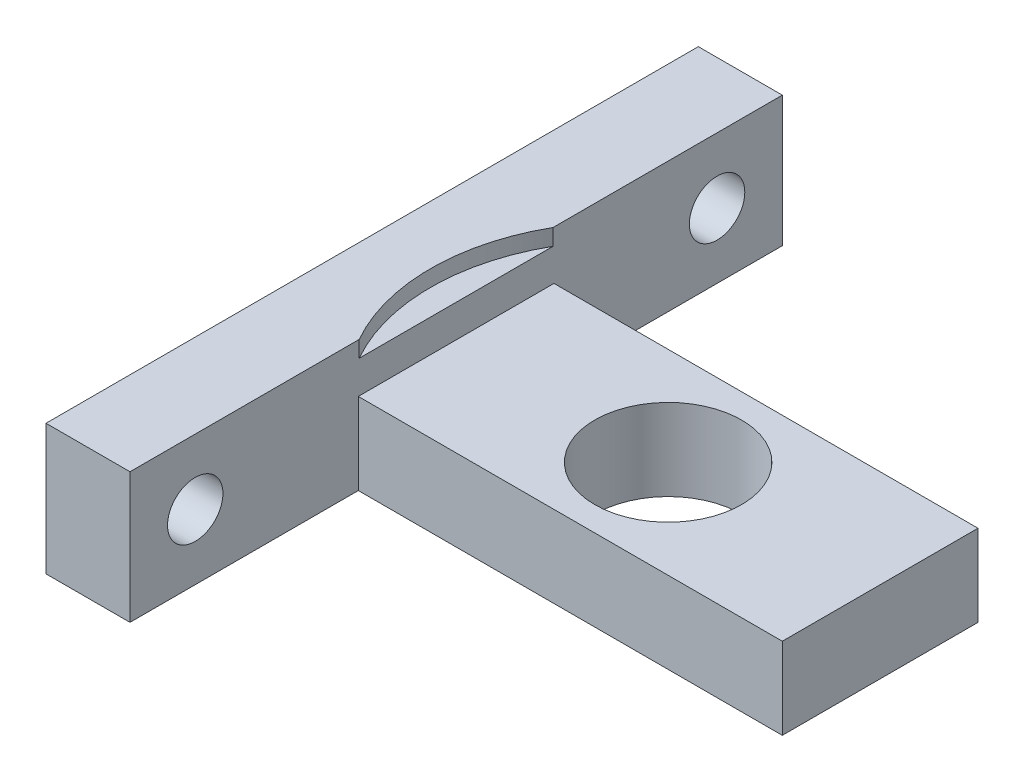
ISO-10303-21;
HEADER;
FILE_DESCRIPTION(('STEP AP214'),'2;1');
FILE_NAME('part.step','',(''),(''),'','','');
FILE_SCHEMA(('AUTOMOTIVE_DESIGN { 1 0 10303 214 1 1 1 1 }'));
ENDSEC;
DATA;
#1=APPLICATION_CONTEXT('core data for automotive mechanical design processes');
#2=APPLICATION_PROTOCOL_DEFINITION('international standard','automotive_design',2000,#1);
#3=PRODUCT_CONTEXT('',#1,'mechanical');
#4=PRODUCT('Part','Part','',(#3));
#5=PRODUCT_RELATED_PRODUCT_CATEGORY('part','',(#4));
#6=PRODUCT_DEFINITION_FORMATION('','',#4);
#7=PRODUCT_DEFINITION_CONTEXT('part definition',#1,'design');
#8=PRODUCT_DEFINITION('design','',#6,#7);
#9=PRODUCT_DEFINITION_SHAPE('','',#8);
#10=(LENGTH_UNIT() NAMED_UNIT(*) SI_UNIT(.MILLI.,.METRE.));
#11=(NAMED_UNIT(*) PLANE_ANGLE_UNIT() SI_UNIT($,.RADIAN.));
#12=(NAMED_UNIT(*) SI_UNIT($,.STERADIAN.) SOLID_ANGLE_UNIT());
#13=UNCERTAINTY_MEASURE_WITH_UNIT(LENGTH_MEASURE(1.E-05),#10,'distance_accuracy_value','');
#14=(GEOMETRIC_REPRESENTATION_CONTEXT(3) GLOBAL_UNCERTAINTY_ASSIGNED_CONTEXT((#13)) GLOBAL_UNIT_ASSIGNED_CONTEXT((#10,
#11,#12)) REPRESENTATION_CONTEXT('',''));
#15=CARTESIAN_POINT('',(0.,0.,0.));
#16=DIRECTION('',(0.,0.,1.));
#17=DIRECTION('',(1.,0.,0.));
#18=AXIS2_PLACEMENT_3D('',#15,#16,#17);
#19=CARTESIAN_POINT('',(-2.575,-8.,20.));
#20=DIRECTION('',(-1.,0.,0.));
#21=DIRECTION('',(0.,0.,1.));
#22=AXIS2_PLACEMENT_3D('',#19,#20,#21);
#23=PLANE('',#22);
#24=CARTESIAN_POINT('',(-2.575,-4.,16.));
#25=DIRECTION('',(-1.,0.,0.));
#26=DIRECTION('',(0.,0.,1.));
#27=AXIS2_PLACEMENT_3D('',#24,#25,#26);
#28=CIRCLE('',#27,1.7);
#29=CARTESIAN_POINT('',(-2.575,-4.,17.7));
#30=VERTEX_POINT('',#29);
#31=EDGE_CURVE('E169',#30,#30,#28,.T.);
#32=ORIENTED_EDGE('',*,*,#31,.F.);
#33=EDGE_LOOP('',(#32));
#34=FACE_BOUND('',#33,.T.);
#35=CARTESIAN_POINT('',(-2.575,-4.,-16.));
#36=DIRECTION('',(-1.,0.,0.));
#37=DIRECTION('',(0.,0.,1.));
#38=AXIS2_PLACEMENT_3D('',#35,#36,#37);
#39=CIRCLE('',#38,1.7);
#40=CARTESIAN_POINT('',(-2.575,-4.,-14.3));
#41=VERTEX_POINT('',#40);
#42=EDGE_CURVE('E164',#41,#41,#39,.T.);
#43=ORIENTED_EDGE('',*,*,#42,.F.);
#44=EDGE_LOOP('',(#43));
#45=FACE_BOUND('',#44,.T.);
#46=DIRECTION('',(0.,0.,1.));
#47=VECTOR('',#46,1.);
#48=CARTESIAN_POINT('',(-2.575,0.,20.));
#49=LINE('',#48,#47);
#50=CARTESIAN_POINT('',(-2.575,0.,-20.));
#51=VERTEX_POINT('',#50);
#52=CARTESIAN_POINT('',(-2.575,0.,20.));
#53=VERTEX_POINT('',#52);
#54=EDGE_CURVE('E172',#51,#53,#49,.T.);
#55=ORIENTED_EDGE('',*,*,#54,.F.);
#56=DIRECTION('',(0.,1.,0.));
#57=VECTOR('',#56,1.);
#58=CARTESIAN_POINT('',(-2.575,-8.,-20.));
#59=LINE('',#58,#57);
#60=CARTESIAN_POINT('',(-2.575,-8.,-20.));
#61=VERTEX_POINT('',#60);
#62=EDGE_CURVE('E43',#61,#51,#59,.T.);
#63=ORIENTED_EDGE('',*,*,#62,.F.);
#64=DIRECTION('',(0.,0.,1.));
#65=VECTOR('',#64,1.);
#66=CARTESIAN_POINT('',(-2.575,-8.,20.));
#67=LINE('',#66,#65);
#68=CARTESIAN_POINT('',(-2.575,-8.,20.));
#69=VERTEX_POINT('',#68);
#70=EDGE_CURVE('E173',#61,#69,#67,.T.);
#71=ORIENTED_EDGE('',*,*,#70,.T.);
#72=DIRECTION('',(0.,1.,0.));
#73=VECTOR('',#72,1.);
#74=CARTESIAN_POINT('',(-2.575,-8.,20.));
#75=LINE('',#74,#73);
#76=EDGE_CURVE('E187',#69,#53,#75,.T.);
#77=ORIENTED_EDGE('',*,*,#76,.T.);
#78=EDGE_LOOP('',(#55,#63,#71,#77));
#79=FACE_BOUND('',#78,.T.);
#80=ADVANCED_FACE('F36',(#34,#45,#79),#23,.T.);
#81=CARTESIAN_POINT('',(2.575,-8.,-20.));
#82=DIRECTION('',(0.,0.,-1.));
#83=DIRECTION('',(-1.,0.,0.));
#84=AXIS2_PLACEMENT_3D('',#81,#82,#83);
#85=PLANE('',#84);
#86=DIRECTION('',(-1.,0.,0.));
#87=VECTOR('',#86,1.);
#88=CARTESIAN_POINT('',(2.575,0.,-20.));
#89=LINE('',#88,#87);
#90=CARTESIAN_POINT('',(2.575,0.,-20.));
#91=VERTEX_POINT('',#90);
#92=EDGE_CURVE('E177',#91,#51,#89,.T.);
#93=ORIENTED_EDGE('',*,*,#92,.F.);
#94=DIRECTION('',(0.,1.,0.));
#95=VECTOR('',#94,1.);
#96=CARTESIAN_POINT('',(2.575,-8.,-20.));
#97=LINE('',#96,#95);
#98=CARTESIAN_POINT('',(2.575,-8.,-20.));
#99=VERTEX_POINT('',#98);
#100=EDGE_CURVE('E199',#99,#91,#97,.T.);
#101=ORIENTED_EDGE('',*,*,#100,.F.);
#102=DIRECTION('',(-1.,0.,0.));
#103=VECTOR('',#102,1.);
#104=CARTESIAN_POINT('',(2.575,-8.,-20.));
#105=LINE('',#104,#103);
#106=EDGE_CURVE('E184',#99,#61,#105,.T.);
#107=ORIENTED_EDGE('',*,*,#106,.T.);
#108=ORIENTED_EDGE('',*,*,#62,.T.);
#109=EDGE_LOOP('',(#93,#101,#107,#108));
#110=FACE_BOUND('',#109,.T.);
#111=ADVANCED_FACE('F215',(#110),#85,.T.);
#112=CARTESIAN_POINT('',(2.575,-8.,20.));
#113=DIRECTION('',(1.,0.,0.));
#114=DIRECTION('',(0.,0.,-1.));
#115=AXIS2_PLACEMENT_3D('',#112,#113,#114);
#116=PLANE('',#115);
#117=DIRECTION('',(0.,1.,0.));
#118=VECTOR('',#117,1.);
#119=CARTESIAN_POINT('',(2.575,-1.,-5.94301060069727));
#120=LINE('',#119,#118);
#121=CARTESIAN_POINT('',(2.575,-1.,-5.94301060069727));
#122=VERTEX_POINT('',#121);
#123=CARTESIAN_POINT('',(2.575,0.,-5.94301060069727));
#124=VERTEX_POINT('',#123);
#125=EDGE_CURVE('E50',#122,#124,#120,.T.);
#126=ORIENTED_EDGE('',*,*,#125,.F.);
#127=DIRECTION('',(0.,0.,1.));
#128=VECTOR('',#127,1.);
#129=CARTESIAN_POINT('',(2.575,-1.,20.));
#130=LINE('',#129,#128);
#131=CARTESIAN_POINT('',(2.575,-1.,5.94301060069727));
#132=VERTEX_POINT('',#131);
#133=EDGE_CURVE('E11',#122,#132,#130,.T.);
#134=ORIENTED_EDGE('',*,*,#133,.T.);
#135=DIRECTION('',(0.,1.,0.));
#136=VECTOR('',#135,1.);
#137=CARTESIAN_POINT('',(2.575,-1.,5.94301060069727));
#138=LINE('',#137,#136);
#139=CARTESIAN_POINT('',(2.575,0.,5.94301060069727));
#140=VERTEX_POINT('',#139);
#141=EDGE_CURVE('E118',#140,#132,#138,.F.);
#142=ORIENTED_EDGE('',*,*,#141,.F.);
#143=DIRECTION('',(0.,0.,-1.));
#144=VECTOR('',#143,1.);
#145=CARTESIAN_POINT('',(2.575,0.,20.));
#146=LINE('',#145,#144);
#147=CARTESIAN_POINT('',(2.575,0.,20.));
#148=VERTEX_POINT('',#147);
#149=EDGE_CURVE('E193',#148,#140,#146,.T.);
#150=ORIENTED_EDGE('',*,*,#149,.F.);
#151=DIRECTION('',(0.,1.,0.));
#152=VECTOR('',#151,1.);
#153=CARTESIAN_POINT('',(2.575,-8.,20.));
#154=LINE('',#153,#152);
#155=CARTESIAN_POINT('',(2.575,-8.,20.));
#156=VERTEX_POINT('',#155);
#157=EDGE_CURVE('E201',#156,#148,#154,.T.);
#158=ORIENTED_EDGE('',*,*,#157,.F.);
#159=DIRECTION('',(0.,0.,-1.));
#160=VECTOR('',#159,1.);
#161=CARTESIAN_POINT('',(2.575,-8.,20.));
#162=LINE('',#161,#160);
#163=CARTESIAN_POINT('',(2.575,-8.,6.));
#164=VERTEX_POINT('',#163);
#165=EDGE_CURVE('E181',#156,#164,#162,.T.);
#166=ORIENTED_EDGE('',*,*,#165,.T.);
#167=DIRECTION('',(0.,-1.,0.));
#168=VECTOR('',#167,1.);
#169=CARTESIAN_POINT('',(2.575,-3.,6.));
#170=LINE('',#169,#168);
#171=CARTESIAN_POINT('',(2.575,-3.,6.));
#172=VERTEX_POINT('',#171);
#173=EDGE_CURVE('E154',#172,#164,#170,.T.);
#174=ORIENTED_EDGE('',*,*,#173,.F.);
#175=DIRECTION('',(0.,0.,1.));
#176=VECTOR('',#175,1.);
#177=CARTESIAN_POINT('',(2.575,-3.,-6.));
#178=LINE('',#177,#176);
#179=CARTESIAN_POINT('',(2.575,-3.,-6.));
#180=VERTEX_POINT('',#179);
#181=EDGE_CURVE('E143',#180,#172,#178,.T.);
#182=ORIENTED_EDGE('',*,*,#181,.F.);
#183=DIRECTION('',(0.,-1.,0.));
#184=VECTOR('',#183,1.);
#185=CARTESIAN_POINT('',(2.575,-3.,-6.));
#186=LINE('',#185,#184);
#187=CARTESIAN_POINT('',(2.575,-8.,-6.00000000000001));
#188=VERTEX_POINT('',#187);
#189=EDGE_CURVE('E156',#180,#188,#186,.T.);
#190=ORIENTED_EDGE('',*,*,#189,.T.);
#191=EDGE_CURVE('E180',#188,#99,#162,.T.);
#192=ORIENTED_EDGE('',*,*,#191,.T.);
#193=ORIENTED_EDGE('',*,*,#100,.T.);
#194=EDGE_CURVE('E125',#124,#91,#146,.T.);
#195=ORIENTED_EDGE('',*,*,#194,.F.);
#196=EDGE_LOOP('',(#126,#134,#142,#150,#158,#166,#174,#182,#190,#192,#193,#195));
#197=FACE_BOUND('',#196,.T.);
#198=CARTESIAN_POINT('',(2.575,-4.,16.));
#199=DIRECTION('',(1.,0.,0.));
#200=DIRECTION('',(0.,0.,-1.));
#201=AXIS2_PLACEMENT_3D('',#198,#199,#200);
#202=CIRCLE('',#201,1.7);
#203=CARTESIAN_POINT('',(2.575,-4.,14.3));
#204=VERTEX_POINT('',#203);
#205=EDGE_CURVE('E161',#204,#204,#202,.T.);
#206=ORIENTED_EDGE('',*,*,#205,.F.);
#207=EDGE_LOOP('',(#206));
#208=FACE_BOUND('',#207,.T.);
#209=CARTESIAN_POINT('',(2.575,-4.,-16.));
#210=DIRECTION('',(1.,0.,0.));
#211=DIRECTION('',(0.,0.,-1.));
#212=AXIS2_PLACEMENT_3D('',#209,#210,#211);
#213=CIRCLE('',#212,1.7);
#214=CARTESIAN_POINT('',(2.575,-4.,-17.7));
#215=VERTEX_POINT('',#214);
#216=EDGE_CURVE('E160',#215,#215,#213,.T.);
#217=ORIENTED_EDGE('',*,*,#216,.F.);
#218=EDGE_LOOP('',(#217));
#219=FACE_BOUND('',#218,.T.);
#220=ADVANCED_FACE('F122',(#197,#208,#219),#116,.T.);
#221=CARTESIAN_POINT('',(2.575,-8.,20.));
#222=DIRECTION('',(0.,0.,1.));
#223=DIRECTION('',(1.,0.,0.));
#224=AXIS2_PLACEMENT_3D('',#221,#222,#223);
#225=PLANE('',#224);
#226=DIRECTION('',(1.,0.,0.));
#227=VECTOR('',#226,1.);
#228=CARTESIAN_POINT('',(2.575,0.,20.));
#229=LINE('',#228,#227);
#230=EDGE_CURVE('E190',#53,#148,#229,.T.);
#231=ORIENTED_EDGE('',*,*,#230,.F.);
#232=ORIENTED_EDGE('',*,*,#76,.F.);
#233=DIRECTION('',(1.,0.,0.));
#234=VECTOR('',#233,1.);
#235=CARTESIAN_POINT('',(2.575,-8.,20.));
#236=LINE('',#235,#234);
#237=EDGE_CURVE('E176',#69,#156,#236,.T.);
#238=ORIENTED_EDGE('',*,*,#237,.T.);
#239=ORIENTED_EDGE('',*,*,#157,.T.);
#240=EDGE_LOOP('',(#231,#232,#238,#239));
#241=FACE_BOUND('',#240,.T.);
#242=ADVANCED_FACE('F208',(#241),#225,.T.);
#243=CARTESIAN_POINT('',(0.,-8.,0.));
#244=DIRECTION('',(0.,1.,0.));
#245=DIRECTION('',(0.,0.,1.));
#246=AXIS2_PLACEMENT_3D('',#243,#244,#245);
#247=PLANE('',#246);
#248=ORIENTED_EDGE('',*,*,#70,.F.);
#249=ORIENTED_EDGE('',*,*,#106,.F.);
#250=ORIENTED_EDGE('',*,*,#191,.F.);
#251=DIRECTION('',(-1.,0.,0.));
#252=VECTOR('',#251,1.);
#253=CARTESIAN_POINT('',(2.575,-8.,-6.));
#254=LINE('',#253,#252);
#255=CARTESIAN_POINT('',(28.575,-8.,-6.));
#256=VERTEX_POINT('',#255);
#257=EDGE_CURVE('E58',#256,#188,#254,.T.);
#258=ORIENTED_EDGE('',*,*,#257,.F.);
#259=DIRECTION('',(0.,0.,-1.));
#260=VECTOR('',#259,1.);
#261=CARTESIAN_POINT('',(28.575,-8.,-6.));
#262=LINE('',#261,#260);
#263=CARTESIAN_POINT('',(28.575,-8.,6.));
#264=VERTEX_POINT('',#263);
#265=EDGE_CURVE('E135',#264,#256,#262,.T.);
#266=ORIENTED_EDGE('',*,*,#265,.F.);
#267=DIRECTION('',(1.,0.,0.));
#268=VECTOR('',#267,1.);
#269=CARTESIAN_POINT('',(2.575,-8.,6.));
#270=LINE('',#269,#268);
#271=EDGE_CURVE('E141',#164,#264,#270,.T.);
#272=ORIENTED_EDGE('',*,*,#271,.F.);
#273=ORIENTED_EDGE('',*,*,#165,.F.);
#274=ORIENTED_EDGE('',*,*,#237,.F.);
#275=EDGE_LOOP('',(#248,#249,#250,#258,#266,#272,#273,#274));
#276=FACE_BOUND('',#275,.T.);
#277=CARTESIAN_POINT('',(15.575,-8.,0.));
#278=DIRECTION('',(0.,1.,0.));
#279=DIRECTION('',(0.,0.,1.));
#280=AXIS2_PLACEMENT_3D('',#277,#278,#279);
#281=CIRCLE('',#280,4.5);
#282=CARTESIAN_POINT('',(15.575,-8.,4.5));
#283=VERTEX_POINT('',#282);
#284=EDGE_CURVE('E126',#283,#283,#281,.T.);
#285=ORIENTED_EDGE('',*,*,#284,.T.);
#286=EDGE_LOOP('',(#285));
#287=FACE_BOUND('',#286,.T.);
#288=ADVANCED_FACE('F218',(#276,#287),#247,.F.);
#289=CARTESIAN_POINT('',(0.,0.,0.));
#290=DIRECTION('',(0.,1.,0.));
#291=DIRECTION('',(0.,0.,1.));
#292=AXIS2_PLACEMENT_3D('',#289,#290,#291);
#293=PLANE('',#292);
#294=CARTESIAN_POINT('',(13.,0.,0.));
#295=DIRECTION('',(0.,1.,0.));
#296=DIRECTION('',(0.,0.,1.));
#297=AXIS2_PLACEMENT_3D('',#294,#295,#296);
#298=CIRCLE('',#297,12.);
#299=EDGE_CURVE('E119',#124,#140,#298,.T.);
#300=ORIENTED_EDGE('',*,*,#299,.F.);
#301=ORIENTED_EDGE('',*,*,#194,.T.);
#302=ORIENTED_EDGE('',*,*,#92,.T.);
#303=ORIENTED_EDGE('',*,*,#54,.T.);
#304=ORIENTED_EDGE('',*,*,#230,.T.);
#305=ORIENTED_EDGE('',*,*,#149,.T.);
#306=EDGE_LOOP('',(#300,#301,#302,#303,#304,#305));
#307=FACE_BOUND('',#306,.T.);
#308=ADVANCED_FACE('F211',(#307),#293,.T.);
#309=CARTESIAN_POINT('',(-8.425,-4.,-16.));
#310=DIRECTION('',(1.,0.,0.));
#311=DIRECTION('',(0.,0.,-1.));
#312=AXIS2_PLACEMENT_3D('',#309,#310,#311);
#313=CYLINDRICAL_SURFACE('',#312,1.7);
#314=ORIENTED_EDGE('',*,*,#42,.T.);
#315=EDGE_LOOP('',(#314));
#316=FACE_BOUND('',#315,.T.);
#317=ORIENTED_EDGE('',*,*,#216,.T.);
#318=EDGE_LOOP('',(#317));
#319=FACE_BOUND('',#318,.T.);
#320=ADVANCED_FACE('F258',(#316,#319),#313,.F.);
#321=CARTESIAN_POINT('',(-8.425,-4.,16.));
#322=DIRECTION('',(1.,0.,0.));
#323=DIRECTION('',(0.,0.,-1.));
#324=AXIS2_PLACEMENT_3D('',#321,#322,#323);
#325=CYLINDRICAL_SURFACE('',#324,1.7);
#326=ORIENTED_EDGE('',*,*,#31,.T.);
#327=EDGE_LOOP('',(#326));
#328=FACE_BOUND('',#327,.T.);
#329=ORIENTED_EDGE('',*,*,#205,.T.);
#330=EDGE_LOOP('',(#329));
#331=FACE_BOUND('',#330,.T.);
#332=ADVANCED_FACE('F245',(#328,#331),#325,.F.);
#333=CARTESIAN_POINT('',(0.,-3.,0.));
#334=DIRECTION('',(0.,1.,0.));
#335=DIRECTION('',(0.,0.,1.));
#336=AXIS2_PLACEMENT_3D('',#333,#334,#335);
#337=PLANE('',#336);
#338=DIRECTION('',(0.,0.,-1.));
#339=VECTOR('',#338,1.);
#340=CARTESIAN_POINT('',(28.575,-3.,-6.));
#341=LINE('',#340,#339);
#342=CARTESIAN_POINT('',(28.575,-3.,6.));
#343=VERTEX_POINT('',#342);
#344=CARTESIAN_POINT('',(28.575,-3.,-6.));
#345=VERTEX_POINT('',#344);
#346=EDGE_CURVE('E137',#343,#345,#341,.T.);
#347=ORIENTED_EDGE('',*,*,#346,.T.);
#348=DIRECTION('',(-1.,0.,0.));
#349=VECTOR('',#348,1.);
#350=CARTESIAN_POINT('',(2.575,-3.,-6.));
#351=LINE('',#350,#349);
#352=EDGE_CURVE('E140',#345,#180,#351,.T.);
#353=ORIENTED_EDGE('',*,*,#352,.T.);
#354=ORIENTED_EDGE('',*,*,#181,.T.);
#355=DIRECTION('',(1.,0.,0.));
#356=VECTOR('',#355,1.);
#357=CARTESIAN_POINT('',(2.575,-3.,6.));
#358=LINE('',#357,#356);
#359=EDGE_CURVE('E145',#172,#343,#358,.T.);
#360=ORIENTED_EDGE('',*,*,#359,.T.);
#361=EDGE_LOOP('',(#347,#353,#354,#360));
#362=FACE_BOUND('',#361,.T.);
#363=CARTESIAN_POINT('',(15.575,-3.,0.));
#364=DIRECTION('',(0.,1.,0.));
#365=DIRECTION('',(0.,0.,1.));
#366=AXIS2_PLACEMENT_3D('',#363,#364,#365);
#367=CIRCLE('',#366,4.5);
#368=CARTESIAN_POINT('',(15.575,-3.,4.5));
#369=VERTEX_POINT('',#368);
#370=EDGE_CURVE('E129',#369,#369,#367,.T.);
#371=ORIENTED_EDGE('',*,*,#370,.F.);
#372=EDGE_LOOP('',(#371));
#373=FACE_BOUND('',#372,.T.);
#374=ADVANCED_FACE('F232',(#362,#373),#337,.T.);
#375=CARTESIAN_POINT('',(28.575,-3.,-6.));
#376=DIRECTION('',(-1.,0.,0.));
#377=DIRECTION('',(0.,0.,1.));
#378=AXIS2_PLACEMENT_3D('',#375,#376,#377);
#379=PLANE('',#378);
#380=ORIENTED_EDGE('',*,*,#265,.T.);
#381=DIRECTION('',(0.,-1.,0.));
#382=VECTOR('',#381,1.);
#383=CARTESIAN_POINT('',(28.575,-3.,-6.));
#384=LINE('',#383,#382);
#385=EDGE_CURVE('E158',#345,#256,#384,.T.);
#386=ORIENTED_EDGE('',*,*,#385,.F.);
#387=ORIENTED_EDGE('',*,*,#346,.F.);
#388=DIRECTION('',(0.,-1.,0.));
#389=VECTOR('',#388,1.);
#390=CARTESIAN_POINT('',(28.575,-3.,6.));
#391=LINE('',#390,#389);
#392=EDGE_CURVE('E147',#343,#264,#391,.T.);
#393=ORIENTED_EDGE('',*,*,#392,.T.);
#394=EDGE_LOOP('',(#380,#386,#387,#393));
#395=FACE_BOUND('',#394,.T.);
#396=ADVANCED_FACE('F237',(#395),#379,.F.);
#397=CARTESIAN_POINT('',(2.575,-3.,-6.));
#398=DIRECTION('',(0.,0.,1.));
#399=DIRECTION('',(1.,0.,0.));
#400=AXIS2_PLACEMENT_3D('',#397,#398,#399);
#401=PLANE('',#400);
#402=ORIENTED_EDGE('',*,*,#257,.T.);
#403=ORIENTED_EDGE('',*,*,#189,.F.);
#404=ORIENTED_EDGE('',*,*,#352,.F.);
#405=ORIENTED_EDGE('',*,*,#385,.T.);
#406=EDGE_LOOP('',(#402,#403,#404,#405));
#407=FACE_BOUND('',#406,.T.);
#408=ADVANCED_FACE('F235',(#407),#401,.F.);
#409=CARTESIAN_POINT('',(2.575,-3.,6.));
#410=DIRECTION('',(0.,0.,-1.));
#411=DIRECTION('',(-1.,0.,0.));
#412=AXIS2_PLACEMENT_3D('',#409,#410,#411);
#413=PLANE('',#412);
#414=ORIENTED_EDGE('',*,*,#271,.T.);
#415=ORIENTED_EDGE('',*,*,#392,.F.);
#416=ORIENTED_EDGE('',*,*,#359,.F.);
#417=ORIENTED_EDGE('',*,*,#173,.T.);
#418=EDGE_LOOP('',(#414,#415,#416,#417));
#419=FACE_BOUND('',#418,.T.);
#420=ADVANCED_FACE('F228',(#419),#413,.F.);
#421=CARTESIAN_POINT('',(15.575,-3.,0.));
#422=DIRECTION('',(0.,-1.,0.));
#423=DIRECTION('',(0.,0.,-1.));
#424=AXIS2_PLACEMENT_3D('',#421,#422,#423);
#425=CYLINDRICAL_SURFACE('',#424,4.5);
#426=ORIENTED_EDGE('',*,*,#370,.T.);
#427=EDGE_LOOP('',(#426));
#428=FACE_BOUND('',#427,.T.);
#429=ORIENTED_EDGE('',*,*,#284,.F.);
#430=EDGE_LOOP('',(#429));
#431=FACE_BOUND('',#430,.T.);
#432=ADVANCED_FACE('F307',(#428,#431),#425,.F.);
#433=CARTESIAN_POINT('',(13.,-1.,0.));
#434=DIRECTION('',(0.,1.,0.));
#435=DIRECTION('',(0.,0.,1.));
#436=AXIS2_PLACEMENT_3D('',#433,#434,#435);
#437=CYLINDRICAL_SURFACE('',#436,12.);
#438=ORIENTED_EDGE('',*,*,#125,.T.);
#439=ORIENTED_EDGE('',*,*,#299,.T.);
#440=ORIENTED_EDGE('',*,*,#141,.T.);
#441=CARTESIAN_POINT('',(13.,-1.,0.));
#442=DIRECTION('',(0.,1.,0.));
#443=DIRECTION('',(0.,0.,1.));
#444=AXIS2_PLACEMENT_3D('',#441,#442,#443);
#445=CIRCLE('',#444,12.);
#446=EDGE_CURVE('E114',#122,#132,#445,.T.);
#447=ORIENTED_EDGE('',*,*,#446,.F.);
#448=EDGE_LOOP('',(#438,#439,#440,#447));
#449=FACE_BOUND('',#448,.T.);
#450=ADVANCED_FACE('F117',(#449),#437,.F.);
#451=CARTESIAN_POINT('',(13.,-1.,0.));
#452=DIRECTION('',(0.,1.,0.));
#453=DIRECTION('',(0.,0.,1.));
#454=AXIS2_PLACEMENT_3D('',#451,#452,#453);
#455=PLANE('',#454);
#456=ORIENTED_EDGE('',*,*,#446,.T.);
#457=ORIENTED_EDGE('',*,*,#133,.F.);
#458=EDGE_LOOP('',(#456,#457));
#459=FACE_BOUND('',#458,.T.);
#460=ADVANCED_FACE('F113',(#459),#455,.T.);
#461=CLOSED_SHELL('',(#80,#111,#220,#242,#288,#308,#320,#332,#374,#396,#408,#420,#432,#450,#460));
#462=MANIFOLD_SOLID_BREP('B2',#461);
#463=ADVANCED_BREP_SHAPE_REPRESENTATION('',(#18,#462),#14);
#464=SHAPE_DEFINITION_REPRESENTATION(#9,#463);
ENDSEC;
END-ISO-10303-21;
